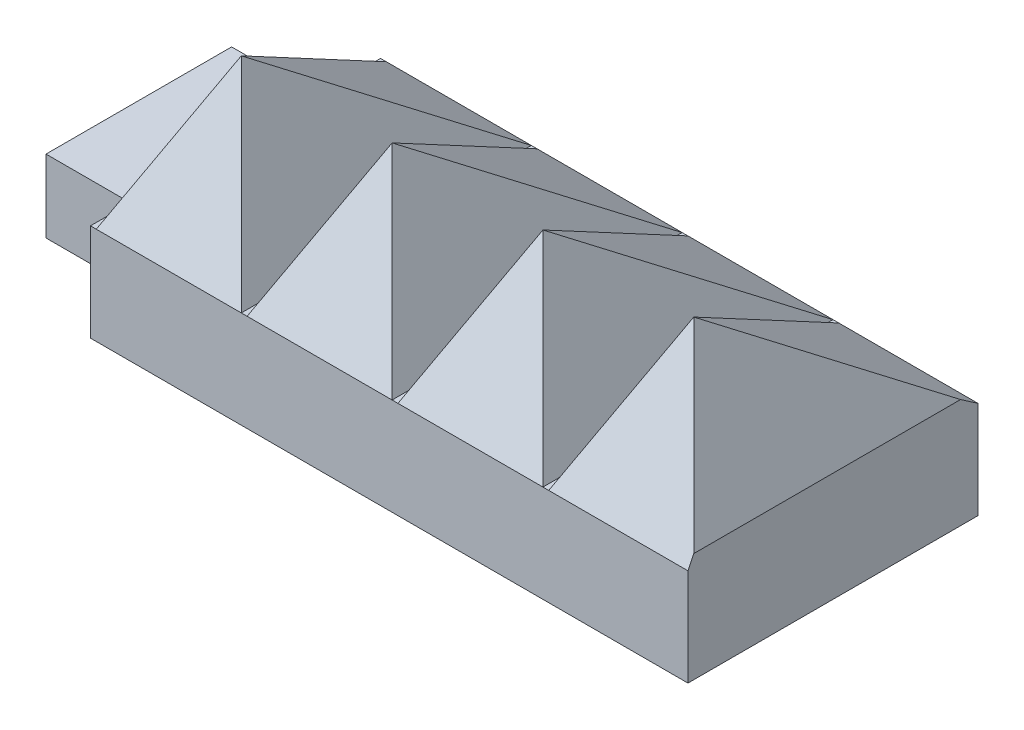
ISO-10303-21;
HEADER;
FILE_DESCRIPTION(('STEP AP214'),'2;1');
FILE_NAME('part.step','',(''),(''),'','','');
FILE_SCHEMA(('AUTOMOTIVE_DESIGN { 1 0 10303 214 1 1 1 1 }'));
ENDSEC;
DATA;
#1=APPLICATION_CONTEXT('core data for automotive mechanical design processes');
#2=APPLICATION_PROTOCOL_DEFINITION('international standard','automotive_design',2000,#1);
#3=PRODUCT_CONTEXT('',#1,'mechanical');
#4=PRODUCT('Part','Part','',(#3));
#5=PRODUCT_RELATED_PRODUCT_CATEGORY('part','',(#4));
#6=PRODUCT_DEFINITION_FORMATION('','',#4);
#7=PRODUCT_DEFINITION_CONTEXT('part definition',#1,'design');
#8=PRODUCT_DEFINITION('design','',#6,#7);
#9=PRODUCT_DEFINITION_SHAPE('','',#8);
#10=(LENGTH_UNIT() NAMED_UNIT(*) SI_UNIT(.MILLI.,.METRE.));
#11=(NAMED_UNIT(*) PLANE_ANGLE_UNIT() SI_UNIT($,.RADIAN.));
#12=(NAMED_UNIT(*) SI_UNIT($,.STERADIAN.) SOLID_ANGLE_UNIT());
#13=UNCERTAINTY_MEASURE_WITH_UNIT(LENGTH_MEASURE(1.E-05),#10,'distance_accuracy_value','');
#14=(GEOMETRIC_REPRESENTATION_CONTEXT(3) GLOBAL_UNCERTAINTY_ASSIGNED_CONTEXT((#13)) GLOBAL_UNIT_ASSIGNED_CONTEXT((#10,
#11,#12)) REPRESENTATION_CONTEXT('',''));
#15=CARTESIAN_POINT('',(0.,0.,0.));
#16=DIRECTION('',(0.,0.,1.));
#17=DIRECTION('',(1.,0.,0.));
#18=AXIS2_PLACEMENT_3D('',#15,#16,#17);
#19=CARTESIAN_POINT('',(137.922,0.,0.));
#20=DIRECTION('',(-1.,0.,0.));
#21=DIRECTION('',(0.,0.,1.));
#22=AXIS2_PLACEMENT_3D('',#19,#20,#21);
#23=PLANE('',#22);
#24=DIRECTION('',(0.,0.,1.));
#25=VECTOR('',#24,1.);
#26=CARTESIAN_POINT('',(137.922,-6.4262,0.));
#27=LINE('',#26,#25);
#28=CARTESIAN_POINT('',(137.922,-6.4262,-9.525));
#29=VERTEX_POINT('',#28);
#30=CARTESIAN_POINT('',(137.922,-6.4262,28.575));
#31=VERTEX_POINT('',#30);
#32=EDGE_CURVE('E241',#29,#31,#27,.T.);
#33=ORIENTED_EDGE('',*,*,#32,.T.);
#34=DIRECTION('',(0.,1.,0.));
#35=VECTOR('',#34,1.);
#36=CARTESIAN_POINT('',(137.922,6.35,28.575));
#37=LINE('',#36,#35);
#38=CARTESIAN_POINT('',(137.922,6.35,28.575));
#39=VERTEX_POINT('',#38);
#40=EDGE_CURVE('E233',#31,#39,#37,.T.);
#41=ORIENTED_EDGE('',*,*,#40,.T.);
#42=DIRECTION('',(0.,0.,-1.));
#43=VECTOR('',#42,1.);
#44=CARTESIAN_POINT('',(137.922,6.35,-9.525));
#45=LINE('',#44,#43);
#46=CARTESIAN_POINT('',(137.922,6.34999999999999,-9.52500000000003));
#47=VERTEX_POINT('',#46);
#48=EDGE_CURVE('E463',#39,#47,#45,.T.);
#49=ORIENTED_EDGE('',*,*,#48,.T.);
#50=DIRECTION('',(0.,1.,0.));
#51=VECTOR('',#50,1.);
#52=CARTESIAN_POINT('',(137.922,6.35,-9.525));
#53=LINE('',#52,#51);
#54=EDGE_CURVE('E230',#29,#47,#53,.T.);
#55=ORIENTED_EDGE('',*,*,#54,.F.);
#56=EDGE_LOOP('',(#33,#41,#49,#55));
#57=FACE_BOUND('',#56,.T.);
#58=DIRECTION('',(0.,0.,-1.));
#59=VECTOR('',#58,1.);
#60=CARTESIAN_POINT('',(137.922,4.7371,-2.66700000000001));
#61=LINE('',#60,#59);
#62=CARTESIAN_POINT('',(137.922,4.7371,21.717));
#63=VERTEX_POINT('',#62);
#64=CARTESIAN_POINT('',(137.922,4.7371,-2.66700000000001));
#65=VERTEX_POINT('',#64);
#66=EDGE_CURVE('E867',#63,#65,#61,.T.);
#67=ORIENTED_EDGE('',*,*,#66,.F.);
#68=DIRECTION('',(0.,1.,0.));
#69=VECTOR('',#68,1.);
#70=CARTESIAN_POINT('',(137.922,-4.8133,21.717));
#71=LINE('',#70,#69);
#72=CARTESIAN_POINT('',(137.922,-4.8133,21.717));
#73=VERTEX_POINT('',#72);
#74=EDGE_CURVE('E228',#73,#63,#71,.T.);
#75=ORIENTED_EDGE('',*,*,#74,.F.);
#76=DIRECTION('',(0.,0.,1.));
#77=VECTOR('',#76,1.);
#78=CARTESIAN_POINT('',(137.922,-4.8133,-2.66700000000001));
#79=LINE('',#78,#77);
#80=CARTESIAN_POINT('',(137.922,-4.8133,-2.66700000000001));
#81=VERTEX_POINT('',#80);
#82=EDGE_CURVE('E224',#81,#73,#79,.T.);
#83=ORIENTED_EDGE('',*,*,#82,.F.);
#84=DIRECTION('',(0.,-1.,0.));
#85=VECTOR('',#84,1.);
#86=CARTESIAN_POINT('',(137.922,-4.8133,-2.66700000000001));
#87=LINE('',#86,#85);
#88=EDGE_CURVE('E864',#65,#81,#87,.T.);
#89=ORIENTED_EDGE('',*,*,#88,.F.);
#90=EDGE_LOOP('',(#67,#75,#83,#89));
#91=FACE_BOUND('',#90,.T.);
#92=ADVANCED_FACE('F78',(#57,#91),#23,.T.);
#93=CARTESIAN_POINT('',(0.,6.35,28.575));
#94=DIRECTION('',(0.,0.,-1.));
#95=DIRECTION('',(-1.,0.,0.));
#96=AXIS2_PLACEMENT_3D('',#93,#94,#95);
#97=PLANE('',#96);
#98=ORIENTED_EDGE('',*,*,#40,.F.);
#99=DIRECTION('',(1.,0.,0.));
#100=VECTOR('',#99,1.);
#101=CARTESIAN_POINT('',(0.,-6.4262,28.575));
#102=LINE('',#101,#100);
#103=CARTESIAN_POINT('',(216.408,-6.4262,28.575));
#104=VERTEX_POINT('',#103);
#105=EDGE_CURVE('E464',#31,#104,#102,.T.);
#106=ORIENTED_EDGE('',*,*,#105,.T.);
#107=DIRECTION('',(0.,1.,0.));
#108=VECTOR('',#107,1.);
#109=CARTESIAN_POINT('',(216.408,-6.4262,28.575));
#110=LINE('',#109,#108);
#111=CARTESIAN_POINT('',(216.408,6.34999999999995,28.575));
#112=VERTEX_POINT('',#111);
#113=EDGE_CURVE('E245',#104,#112,#110,.T.);
#114=ORIENTED_EDGE('',*,*,#113,.T.);
#115=DIRECTION('',(1.,0.,0.));
#116=VECTOR('',#115,1.);
#117=CARTESIAN_POINT('',(198.12,6.35,28.575));
#118=LINE('',#117,#116);
#119=CARTESIAN_POINT('',(198.12,6.35,28.575));
#120=VERTEX_POINT('',#119);
#121=EDGE_CURVE('E327',#120,#112,#118,.T.);
#122=ORIENTED_EDGE('',*,*,#121,.F.);
#123=DIRECTION('',(1.,0.,0.));
#124=VECTOR('',#123,1.);
#125=CARTESIAN_POINT('',(0.,6.35,28.575));
#126=LINE('',#125,#124);
#127=CARTESIAN_POINT('',(197.358,6.35,28.575));
#128=VERTEX_POINT('',#127);
#129=EDGE_CURVE('E408',#128,#120,#126,.T.);
#130=ORIENTED_EDGE('',*,*,#129,.F.);
#131=DIRECTION('',(1.,0.,0.));
#132=VECTOR('',#131,1.);
#133=CARTESIAN_POINT('',(178.308,6.35,28.575));
#134=LINE('',#133,#132);
#135=CARTESIAN_POINT('',(178.308,6.35,28.575));
#136=VERTEX_POINT('',#135);
#137=EDGE_CURVE('E577',#136,#128,#134,.T.);
#138=ORIENTED_EDGE('',*,*,#137,.F.);
#139=CARTESIAN_POINT('',(177.546,6.35,28.575));
#140=VERTEX_POINT('',#139);
#141=EDGE_CURVE('E428',#140,#136,#126,.T.);
#142=ORIENTED_EDGE('',*,*,#141,.F.);
#143=DIRECTION('',(1.,0.,0.));
#144=VECTOR('',#143,1.);
#145=CARTESIAN_POINT('',(158.496,6.35,28.575));
#146=LINE('',#145,#144);
#147=CARTESIAN_POINT('',(158.496,6.35,28.575));
#148=VERTEX_POINT('',#147);
#149=EDGE_CURVE('E399',#148,#140,#146,.T.);
#150=ORIENTED_EDGE('',*,*,#149,.F.);
#151=CARTESIAN_POINT('',(157.734,6.35,28.575));
#152=VERTEX_POINT('',#151);
#153=EDGE_CURVE('E425',#152,#148,#126,.T.);
#154=ORIENTED_EDGE('',*,*,#153,.F.);
#155=DIRECTION('',(1.,0.,0.));
#156=VECTOR('',#155,1.);
#157=CARTESIAN_POINT('',(138.684,6.35,28.575));
#158=LINE('',#157,#156);
#159=CARTESIAN_POINT('',(138.684,6.35,28.575));
#160=VERTEX_POINT('',#159);
#161=EDGE_CURVE('E465',#160,#152,#158,.T.);
#162=ORIENTED_EDGE('',*,*,#161,.F.);
#163=EDGE_CURVE('E407',#39,#160,#126,.T.);
#164=ORIENTED_EDGE('',*,*,#163,.F.);
#165=EDGE_LOOP('',(#98,#106,#114,#122,#130,#138,#142,#150,#154,#162,#164));
#166=FACE_BOUND('',#165,.T.);
#167=ADVANCED_FACE('F350',(#166),#97,.F.);
#168=CARTESIAN_POINT('',(0.,6.35,-9.525));
#169=DIRECTION('',(0.,0.,-1.));
#170=DIRECTION('',(-1.,0.,0.));
#171=AXIS2_PLACEMENT_3D('',#168,#169,#170);
#172=PLANE('',#171);
#173=DIRECTION('',(1.,0.,0.));
#174=VECTOR('',#173,1.);
#175=CARTESIAN_POINT('',(0.,-6.4262,-9.525));
#176=LINE('',#175,#174);
#177=CARTESIAN_POINT('',(216.408,-6.4262,-9.525));
#178=VERTEX_POINT('',#177);
#179=EDGE_CURVE('E635',#29,#178,#176,.T.);
#180=ORIENTED_EDGE('',*,*,#179,.F.);
#181=ORIENTED_EDGE('',*,*,#54,.T.);
#182=DIRECTION('',(1.,0.,0.));
#183=VECTOR('',#182,1.);
#184=CARTESIAN_POINT('',(0.,6.35,-9.525));
#185=LINE('',#184,#183);
#186=CARTESIAN_POINT('',(138.684,6.35,-9.525));
#187=VERTEX_POINT('',#186);
#188=EDGE_CURVE('E415',#47,#187,#185,.T.);
#189=ORIENTED_EDGE('',*,*,#188,.T.);
#190=DIRECTION('',(-1.,0.,0.));
#191=VECTOR('',#190,1.);
#192=CARTESIAN_POINT('',(138.684,6.35,-9.525));
#193=LINE('',#192,#191);
#194=CARTESIAN_POINT('',(157.734,6.35,-9.525));
#195=VERTEX_POINT('',#194);
#196=EDGE_CURVE('E460',#195,#187,#193,.T.);
#197=ORIENTED_EDGE('',*,*,#196,.F.);
#198=CARTESIAN_POINT('',(158.496,6.35,-9.525));
#199=VERTEX_POINT('',#198);
#200=EDGE_CURVE('E422',#195,#199,#185,.T.);
#201=ORIENTED_EDGE('',*,*,#200,.T.);
#202=DIRECTION('',(-1.,0.,0.));
#203=VECTOR('',#202,1.);
#204=CARTESIAN_POINT('',(158.496,6.35,-9.525));
#205=LINE('',#204,#203);
#206=CARTESIAN_POINT('',(177.546,6.35,-9.525));
#207=VERTEX_POINT('',#206);
#208=EDGE_CURVE('E369',#207,#199,#205,.T.);
#209=ORIENTED_EDGE('',*,*,#208,.F.);
#210=CARTESIAN_POINT('',(178.308,6.35,-9.525));
#211=VERTEX_POINT('',#210);
#212=EDGE_CURVE('E406',#207,#211,#185,.T.);
#213=ORIENTED_EDGE('',*,*,#212,.T.);
#214=DIRECTION('',(-1.,0.,0.));
#215=VECTOR('',#214,1.);
#216=CARTESIAN_POINT('',(178.308,6.35,-9.525));
#217=LINE('',#216,#215);
#218=CARTESIAN_POINT('',(197.358,6.35,-9.525));
#219=VERTEX_POINT('',#218);
#220=EDGE_CURVE('E564',#219,#211,#217,.T.);
#221=ORIENTED_EDGE('',*,*,#220,.F.);
#222=CARTESIAN_POINT('',(198.12,6.35,-9.525));
#223=VERTEX_POINT('',#222);
#224=EDGE_CURVE('E403',#219,#223,#185,.T.);
#225=ORIENTED_EDGE('',*,*,#224,.T.);
#226=DIRECTION('',(-1.,0.,0.));
#227=VECTOR('',#226,1.);
#228=CARTESIAN_POINT('',(198.12,6.35,-9.525));
#229=LINE('',#228,#227);
#230=CARTESIAN_POINT('',(216.408,6.35,-9.525));
#231=VERTEX_POINT('',#230);
#232=EDGE_CURVE('E320',#231,#223,#229,.T.);
#233=ORIENTED_EDGE('',*,*,#232,.F.);
#234=DIRECTION('',(0.,1.,0.));
#235=VECTOR('',#234,1.);
#236=CARTESIAN_POINT('',(216.408,-6.4262,-9.525));
#237=LINE('',#236,#235);
#238=EDGE_CURVE('E253',#178,#231,#237,.T.);
#239=ORIENTED_EDGE('',*,*,#238,.F.);
#240=EDGE_LOOP('',(#180,#181,#189,#197,#201,#209,#213,#221,#225,#233,#239));
#241=FACE_BOUND('',#240,.T.);
#242=ADVANCED_FACE('F340',(#241),#172,.T.);
#243=CARTESIAN_POINT('',(0.,-6.4262,0.));
#244=DIRECTION('',(0.,1.,0.));
#245=DIRECTION('',(0.,0.,1.));
#246=AXIS2_PLACEMENT_3D('',#243,#244,#245);
#247=PLANE('',#246);
#248=CARTESIAN_POINT('',(179.07,-6.4262,9.525));
#249=DIRECTION('',(0.,1.,0.));
#250=DIRECTION('',(0.,0.,1.));
#251=AXIS2_PLACEMENT_3D('',#248,#249,#250);
#252=CIRCLE('',#251,12.192);
#253=CARTESIAN_POINT('',(179.07,-6.4262,21.717));
#254=VERTEX_POINT('',#253);
#255=EDGE_CURVE('E88',#254,#254,#252,.F.);
#256=ORIENTED_EDGE('',*,*,#255,.F.);
#257=EDGE_LOOP('',(#256));
#258=FACE_BOUND('',#257,.T.);
#259=ORIENTED_EDGE('',*,*,#32,.F.);
#260=ORIENTED_EDGE('',*,*,#179,.T.);
#261=DIRECTION('',(0.,0.,-1.));
#262=VECTOR('',#261,1.);
#263=CARTESIAN_POINT('',(216.408,-6.4262,28.575));
#264=LINE('',#263,#262);
#265=EDGE_CURVE('E254',#104,#178,#264,.T.);
#266=ORIENTED_EDGE('',*,*,#265,.F.);
#267=ORIENTED_EDGE('',*,*,#105,.F.);
#268=EDGE_LOOP('',(#259,#260,#266,#267));
#269=FACE_BOUND('',#268,.T.);
#270=ADVANCED_FACE('F349',(#258,#269),#247,.F.);
#271=CARTESIAN_POINT('',(0.,6.35,0.));
#272=DIRECTION('',(0.,1.,0.));
#273=DIRECTION('',(0.,0.,1.));
#274=AXIS2_PLACEMENT_3D('',#271,#272,#273);
#275=PLANE('',#274);
#276=ORIENTED_EDGE('',*,*,#129,.T.);
#277=DIRECTION('',(0.,0.,1.));
#278=VECTOR('',#277,1.);
#279=CARTESIAN_POINT('',(198.12,6.35,-9.525));
#280=LINE('',#279,#278);
#281=EDGE_CURVE('E338',#223,#120,#280,.T.);
#282=ORIENTED_EDGE('',*,*,#281,.F.);
#283=ORIENTED_EDGE('',*,*,#224,.F.);
#284=DIRECTION('',(0.,0.,-1.));
#285=VECTOR('',#284,1.);
#286=CARTESIAN_POINT('',(197.358,6.35,-9.525));
#287=LINE('',#286,#285);
#288=EDGE_CURVE('E570',#128,#219,#287,.T.);
#289=ORIENTED_EDGE('',*,*,#288,.F.);
#290=EDGE_LOOP('',(#276,#282,#283,#289));
#291=FACE_BOUND('',#290,.T.);
#292=ADVANCED_FACE('F80',(#291),#275,.T.);
#293=ORIENTED_EDGE('',*,*,#141,.T.);
#294=DIRECTION('',(0.,0.,1.));
#295=VECTOR('',#294,1.);
#296=CARTESIAN_POINT('',(178.308,6.35,-9.525));
#297=LINE('',#296,#295);
#298=EDGE_CURVE('E584',#211,#136,#297,.T.);
#299=ORIENTED_EDGE('',*,*,#298,.F.);
#300=ORIENTED_EDGE('',*,*,#212,.F.);
#301=DIRECTION('',(0.,0.,-1.));
#302=VECTOR('',#301,1.);
#303=CARTESIAN_POINT('',(177.546,6.35,-9.525));
#304=LINE('',#303,#302);
#305=EDGE_CURVE('E379',#140,#207,#304,.T.);
#306=ORIENTED_EDGE('',*,*,#305,.F.);
#307=EDGE_LOOP('',(#293,#299,#300,#306));
#308=FACE_BOUND('',#307,.T.);
#309=ADVANCED_FACE('F649',(#308),#275,.T.);
#310=ORIENTED_EDGE('',*,*,#153,.T.);
#311=DIRECTION('',(0.,0.,1.));
#312=VECTOR('',#311,1.);
#313=CARTESIAN_POINT('',(158.496,6.35,-9.525));
#314=LINE('',#313,#312);
#315=EDGE_CURVE('E380',#199,#148,#314,.T.);
#316=ORIENTED_EDGE('',*,*,#315,.F.);
#317=ORIENTED_EDGE('',*,*,#200,.F.);
#318=DIRECTION('',(0.,0.,-1.));
#319=VECTOR('',#318,1.);
#320=CARTESIAN_POINT('',(157.734,6.35,-9.525));
#321=LINE('',#320,#319);
#322=EDGE_CURVE('E434',#152,#195,#321,.T.);
#323=ORIENTED_EDGE('',*,*,#322,.F.);
#324=EDGE_LOOP('',(#310,#316,#317,#323));
#325=FACE_BOUND('',#324,.T.);
#326=ADVANCED_FACE('F511',(#325),#275,.T.);
#327=ORIENTED_EDGE('',*,*,#163,.T.);
#328=DIRECTION('',(0.,0.,1.));
#329=VECTOR('',#328,1.);
#330=CARTESIAN_POINT('',(138.684,6.35,-9.525));
#331=LINE('',#330,#329);
#332=EDGE_CURVE('E449',#187,#160,#331,.T.);
#333=ORIENTED_EDGE('',*,*,#332,.F.);
#334=ORIENTED_EDGE('',*,*,#188,.F.);
#335=ORIENTED_EDGE('',*,*,#48,.F.);
#336=EDGE_LOOP('',(#327,#333,#334,#335));
#337=FACE_BOUND('',#336,.T.);
#338=ADVANCED_FACE('F650',(#337),#275,.T.);
#339=CARTESIAN_POINT('',(136.197317378927,1.20090918596555,0.));
#340=DIRECTION('',(0.900489002239912,-0.434878784082378,0.));
#341=DIRECTION('',(0.434878784082378,0.900489002239912,0.));
#342=AXIS2_PLACEMENT_3D('',#339,#340,#341);
#343=PLANE('',#342);
#344=DIRECTION('',(0.398800284879998,0.825782456558182,-0.398800284879998));
#345=VECTOR('',#344,1.);
#346=CARTESIAN_POINT('',(138.684,6.35,28.575));
#347=LINE('',#346,#345);
#348=CARTESIAN_POINT('',(148.209,26.0731,19.05));
#349=VERTEX_POINT('',#348);
#350=EDGE_CURVE('E1010',#160,#349,#347,.T.);
#351=ORIENTED_EDGE('',*,*,#350,.T.);
#352=DIRECTION('',(0.264557111265544,0.547809591727186,0.793671333796632));
#353=VECTOR('',#352,1.);
#354=CARTESIAN_POINT('',(138.684,6.35,-9.525));
#355=LINE('',#354,#353);
#356=EDGE_CURVE('E1014',#187,#349,#355,.T.);
#357=ORIENTED_EDGE('',*,*,#356,.F.);
#358=ORIENTED_EDGE('',*,*,#332,.T.);
#359=EDGE_LOOP('',(#351,#357,#358));
#360=FACE_BOUND('',#359,.T.);
#361=ADVANCED_FACE('F810',(#360),#343,.F.);
#362=CARTESIAN_POINT('',(138.684,8.7539338084631,-6.04215964646364));
#363=DIRECTION('',(0.,-0.82299461575022,0.568049172560041));
#364=DIRECTION('',(0.,-0.568049172560041,-0.82299461575022));
#365=AXIS2_PLACEMENT_3D('',#362,#363,#364);
#366=PLANE('',#365);
#367=ORIENTED_EDGE('',*,*,#356,.T.);
#368=DIRECTION('',(-0.264557111265544,0.547809591727186,0.793671333796632));
#369=VECTOR('',#368,1.);
#370=CARTESIAN_POINT('',(157.734,6.35,-9.525));
#371=LINE('',#370,#369);
#372=EDGE_CURVE('E378',#195,#349,#371,.T.);
#373=ORIENTED_EDGE('',*,*,#372,.F.);
#374=ORIENTED_EDGE('',*,*,#196,.T.);
#375=EDGE_LOOP('',(#367,#373,#374));
#376=FACE_BOUND('',#375,.T.);
#377=ADVANCED_FACE('F879',(#376),#366,.F.);
#378=CARTESIAN_POINT('',(138.684,12.3909809807925,25.6575912842277));
#379=DIRECTION('',(0.,-0.434878784082379,-0.900489002239912));
#380=DIRECTION('',(0.,0.900489002239912,-0.434878784082379));
#381=AXIS2_PLACEMENT_3D('',#378,#379,#380);
#382=PLANE('',#381);
#383=DIRECTION('',(-0.398800284879998,0.825782456558182,-0.398800284879998));
#384=VECTOR('',#383,1.);
#385=CARTESIAN_POINT('',(157.734,6.35,28.575));
#386=LINE('',#385,#384);
#387=EDGE_CURVE('E1007',#152,#349,#386,.T.);
#388=ORIENTED_EDGE('',*,*,#387,.T.);
#389=ORIENTED_EDGE('',*,*,#350,.F.);
#390=ORIENTED_EDGE('',*,*,#161,.T.);
#391=EDGE_LOOP('',(#388,#389,#390));
#392=FACE_BOUND('',#391,.T.);
#393=ADVANCED_FACE('F887',(#392),#382,.F.);
#394=CARTESIAN_POINT('',(156.617955063176,8.66095704918353,0.));
#395=DIRECTION('',(-0.900489002239912,-0.434878784082379,0.));
#396=DIRECTION('',(0.434878784082379,-0.900489002239912,0.));
#397=AXIS2_PLACEMENT_3D('',#394,#395,#396);
#398=PLANE('',#397);
#399=ORIENTED_EDGE('',*,*,#372,.T.);
#400=ORIENTED_EDGE('',*,*,#387,.F.);
#401=ORIENTED_EDGE('',*,*,#322,.T.);
#402=EDGE_LOOP('',(#399,#400,#401));
#403=FACE_BOUND('',#402,.T.);
#404=ADVANCED_FACE('F543',(#403),#398,.F.);
#405=CARTESIAN_POINT('',(156.009317378927,1.20090918596555,0.));
#406=DIRECTION('',(0.900489002239912,-0.434878784082378,0.));
#407=DIRECTION('',(0.434878784082378,0.900489002239912,0.));
#408=AXIS2_PLACEMENT_3D('',#405,#406,#407);
#409=PLANE('',#408);
#410=DIRECTION('',(0.398800284879998,0.825782456558182,-0.398800284879998));
#411=VECTOR('',#410,1.);
#412=CARTESIAN_POINT('',(158.496,6.35,28.575));
#413=LINE('',#412,#411);
#414=CARTESIAN_POINT('',(168.021,26.0731,19.05));
#415=VERTEX_POINT('',#414);
#416=EDGE_CURVE('E517',#148,#415,#413,.T.);
#417=ORIENTED_EDGE('',*,*,#416,.T.);
#418=DIRECTION('',(0.264557111265544,0.547809591727186,0.793671333796632));
#419=VECTOR('',#418,1.);
#420=CARTESIAN_POINT('',(158.496,6.35,-9.525));
#421=LINE('',#420,#419);
#422=EDGE_CURVE('E516',#199,#415,#421,.T.);
#423=ORIENTED_EDGE('',*,*,#422,.F.);
#424=ORIENTED_EDGE('',*,*,#315,.T.);
#425=EDGE_LOOP('',(#417,#423,#424));
#426=FACE_BOUND('',#425,.T.);
#427=ADVANCED_FACE('F532',(#426),#409,.F.);
#428=CARTESIAN_POINT('',(158.496,8.7539338084631,-6.04215964646364));
#429=DIRECTION('',(0.,-0.82299461575022,0.568049172560041));
#430=DIRECTION('',(0.,-0.568049172560041,-0.82299461575022));
#431=AXIS2_PLACEMENT_3D('',#428,#429,#430);
#432=PLANE('',#431);
#433=ORIENTED_EDGE('',*,*,#422,.T.);
#434=DIRECTION('',(-0.264557111265544,0.547809591727186,0.793671333796632));
#435=VECTOR('',#434,1.);
#436=CARTESIAN_POINT('',(177.546,6.35,-9.525));
#437=LINE('',#436,#435);
#438=EDGE_CURVE('E557',#207,#415,#437,.T.);
#439=ORIENTED_EDGE('',*,*,#438,.F.);
#440=ORIENTED_EDGE('',*,*,#208,.T.);
#441=EDGE_LOOP('',(#433,#439,#440));
#442=FACE_BOUND('',#441,.T.);
#443=ADVANCED_FACE('F542',(#442),#432,.F.);
#444=CARTESIAN_POINT('',(158.496,12.3909809807925,25.6575912842277));
#445=DIRECTION('',(0.,-0.434878784082379,-0.900489002239912));
#446=DIRECTION('',(0.,0.900489002239912,-0.434878784082379));
#447=AXIS2_PLACEMENT_3D('',#444,#445,#446);
#448=PLANE('',#447);
#449=DIRECTION('',(-0.398800284879998,0.825782456558182,-0.398800284879998));
#450=VECTOR('',#449,1.);
#451=CARTESIAN_POINT('',(177.546,6.35,28.575));
#452=LINE('',#451,#450);
#453=EDGE_CURVE('E520',#140,#415,#452,.T.);
#454=ORIENTED_EDGE('',*,*,#453,.T.);
#455=ORIENTED_EDGE('',*,*,#416,.F.);
#456=ORIENTED_EDGE('',*,*,#149,.T.);
#457=EDGE_LOOP('',(#454,#455,#456));
#458=FACE_BOUND('',#457,.T.);
#459=ADVANCED_FACE('F550',(#458),#448,.F.);
#460=CARTESIAN_POINT('',(176.429955063176,8.66095704918353,0.));
#461=DIRECTION('',(-0.900489002239912,-0.434878784082379,0.));
#462=DIRECTION('',(0.434878784082379,-0.900489002239912,0.));
#463=AXIS2_PLACEMENT_3D('',#460,#461,#462);
#464=PLANE('',#463);
#465=ORIENTED_EDGE('',*,*,#438,.T.);
#466=ORIENTED_EDGE('',*,*,#453,.F.);
#467=ORIENTED_EDGE('',*,*,#305,.T.);
#468=EDGE_LOOP('',(#465,#466,#467));
#469=FACE_BOUND('',#468,.T.);
#470=ADVANCED_FACE('F724',(#469),#464,.F.);
#471=CARTESIAN_POINT('',(175.821317378927,1.20090918596555,0.));
#472=DIRECTION('',(0.900489002239912,-0.434878784082378,0.));
#473=DIRECTION('',(0.434878784082378,0.900489002239912,0.));
#474=AXIS2_PLACEMENT_3D('',#471,#472,#473);
#475=PLANE('',#474);
#476=DIRECTION('',(0.398800284879998,0.825782456558182,-0.398800284879998));
#477=VECTOR('',#476,1.);
#478=CARTESIAN_POINT('',(178.308,6.35,28.575));
#479=LINE('',#478,#477);
#480=CARTESIAN_POINT('',(187.833,26.0731,19.05));
#481=VERTEX_POINT('',#480);
#482=EDGE_CURVE('E694',#136,#481,#479,.T.);
#483=ORIENTED_EDGE('',*,*,#482,.T.);
#484=DIRECTION('',(0.264557111265544,0.547809591727186,0.793671333796632));
#485=VECTOR('',#484,1.);
#486=CARTESIAN_POINT('',(178.308,6.35,-9.525));
#487=LINE('',#486,#485);
#488=EDGE_CURVE('E703',#211,#481,#487,.T.);
#489=ORIENTED_EDGE('',*,*,#488,.F.);
#490=ORIENTED_EDGE('',*,*,#298,.T.);
#491=EDGE_LOOP('',(#483,#489,#490));
#492=FACE_BOUND('',#491,.T.);
#493=ADVANCED_FACE('F715',(#492),#475,.F.);
#494=CARTESIAN_POINT('',(178.308,8.7539338084631,-6.04215964646364));
#495=DIRECTION('',(0.,-0.82299461575022,0.568049172560041));
#496=DIRECTION('',(0.,-0.568049172560041,-0.82299461575022));
#497=AXIS2_PLACEMENT_3D('',#494,#495,#496);
#498=PLANE('',#497);
#499=ORIENTED_EDGE('',*,*,#488,.T.);
#500=DIRECTION('',(-0.264557111265544,0.547809591727186,0.793671333796632));
#501=VECTOR('',#500,1.);
#502=CARTESIAN_POINT('',(197.358,6.35,-9.525));
#503=LINE('',#502,#501);
#504=EDGE_CURVE('E690',#219,#481,#503,.T.);
#505=ORIENTED_EDGE('',*,*,#504,.F.);
#506=ORIENTED_EDGE('',*,*,#220,.T.);
#507=EDGE_LOOP('',(#499,#505,#506));
#508=FACE_BOUND('',#507,.T.);
#509=ADVANCED_FACE('F723',(#508),#498,.F.);
#510=CARTESIAN_POINT('',(178.308,12.3909809807925,25.6575912842277));
#511=DIRECTION('',(0.,-0.434878784082379,-0.900489002239912));
#512=DIRECTION('',(0.,0.900489002239912,-0.434878784082379));
#513=AXIS2_PLACEMENT_3D('',#510,#511,#512);
#514=PLANE('',#513);
#515=DIRECTION('',(-0.398800284879998,0.825782456558182,-0.398800284879998));
#516=VECTOR('',#515,1.);
#517=CARTESIAN_POINT('',(197.358,6.35,28.575));
#518=LINE('',#517,#516);
#519=EDGE_CURVE('E691',#128,#481,#518,.T.);
#520=ORIENTED_EDGE('',*,*,#519,.T.);
#521=ORIENTED_EDGE('',*,*,#482,.F.);
#522=ORIENTED_EDGE('',*,*,#137,.T.);
#523=EDGE_LOOP('',(#520,#521,#522));
#524=FACE_BOUND('',#523,.T.);
#525=ADVANCED_FACE('F727',(#524),#514,.F.);
#526=CARTESIAN_POINT('',(196.241955063176,8.66095704918353,0.));
#527=DIRECTION('',(-0.900489002239912,-0.434878784082379,0.));
#528=DIRECTION('',(0.434878784082379,-0.900489002239912,0.));
#529=AXIS2_PLACEMENT_3D('',#526,#527,#528);
#530=PLANE('',#529);
#531=ORIENTED_EDGE('',*,*,#504,.T.);
#532=ORIENTED_EDGE('',*,*,#519,.F.);
#533=ORIENTED_EDGE('',*,*,#288,.T.);
#534=EDGE_LOOP('',(#531,#532,#533));
#535=FACE_BOUND('',#534,.T.);
#536=ADVANCED_FACE('F544',(#535),#530,.F.);
#537=CARTESIAN_POINT('',(195.633317378927,1.20090918596555,0.));
#538=DIRECTION('',(0.900489002239912,-0.434878784082378,0.));
#539=DIRECTION('',(0.434878784082378,0.900489002239912,0.));
#540=AXIS2_PLACEMENT_3D('',#537,#538,#539);
#541=PLANE('',#540);
#542=DIRECTION('',(0.398800284879998,0.825782456558182,-0.398800284879998));
#543=VECTOR('',#542,1.);
#544=CARTESIAN_POINT('',(198.12,6.35,28.575));
#545=LINE('',#544,#543);
#546=CARTESIAN_POINT('',(207.645,26.0731,19.05));
#547=VERTEX_POINT('',#546);
#548=EDGE_CURVE('E315',#120,#547,#545,.T.);
#549=ORIENTED_EDGE('',*,*,#548,.T.);
#550=DIRECTION('',(0.264557111265544,0.547809591727186,0.793671333796632));
#551=VECTOR('',#550,1.);
#552=CARTESIAN_POINT('',(198.12,6.35,-9.525));
#553=LINE('',#552,#551);
#554=EDGE_CURVE('E610',#223,#547,#553,.T.);
#555=ORIENTED_EDGE('',*,*,#554,.F.);
#556=ORIENTED_EDGE('',*,*,#281,.T.);
#557=EDGE_LOOP('',(#549,#555,#556));
#558=FACE_BOUND('',#557,.T.);
#559=ADVANCED_FACE('F286',(#558),#541,.F.);
#560=CARTESIAN_POINT('',(198.12,8.7539338084631,-6.04215964646364));
#561=DIRECTION('',(0.,-0.82299461575022,0.568049172560041));
#562=DIRECTION('',(0.,-0.568049172560041,-0.82299461575022));
#563=AXIS2_PLACEMENT_3D('',#560,#561,#562);
#564=PLANE('',#563);
#565=DIRECTION('',(-0.264557111265544,0.547809591727186,0.793671333796632));
#566=VECTOR('',#565,1.);
#567=CARTESIAN_POINT('',(217.17,6.35,-9.525));
#568=LINE('',#567,#566);
#569=CARTESIAN_POINT('',(216.408,7.92784800000001,-7.23899999999999));
#570=VERTEX_POINT('',#569);
#571=EDGE_CURVE('E267',#570,#547,#568,.T.);
#572=ORIENTED_EDGE('',*,*,#571,.F.);
#573=DIRECTION('',(0.,-0.568049172560041,-0.82299461575022));
#574=VECTOR('',#573,1.);
#575=CARTESIAN_POINT('',(216.408,8.7539338084631,-6.04215964646364));
#576=LINE('',#575,#574);
#577=EDGE_CURVE('E104',#570,#231,#576,.T.);
#578=ORIENTED_EDGE('',*,*,#577,.T.);
#579=ORIENTED_EDGE('',*,*,#232,.T.);
#580=ORIENTED_EDGE('',*,*,#554,.T.);
#581=EDGE_LOOP('',(#572,#578,#579,#580));
#582=FACE_BOUND('',#581,.T.);
#583=ADVANCED_FACE('F275',(#582),#564,.F.);
#584=CARTESIAN_POINT('',(198.12,12.3909809807925,25.6575912842277));
#585=DIRECTION('',(0.,-0.434878784082379,-0.900489002239912));
#586=DIRECTION('',(0.,0.900489002239912,-0.434878784082379));
#587=AXIS2_PLACEMENT_3D('',#584,#585,#586);
#588=PLANE('',#587);
#589=ORIENTED_EDGE('',*,*,#121,.T.);
#590=DIRECTION('',(0.,0.900489002239912,-0.434878784082379));
#591=VECTOR('',#590,1.);
#592=CARTESIAN_POINT('',(216.408,12.3909809807925,25.6575912842277));
#593=LINE('',#592,#591);
#594=CARTESIAN_POINT('',(216.408,7.92784800000002,27.813));
#595=VERTEX_POINT('',#594);
#596=EDGE_CURVE('E256',#112,#595,#593,.T.);
#597=ORIENTED_EDGE('',*,*,#596,.T.);
#598=DIRECTION('',(-0.398800284879998,0.825782456558182,-0.398800284879998));
#599=VECTOR('',#598,1.);
#600=CARTESIAN_POINT('',(217.17,6.35,28.575));
#601=LINE('',#600,#599);
#602=EDGE_CURVE('E313',#595,#547,#601,.T.);
#603=ORIENTED_EDGE('',*,*,#602,.T.);
#604=ORIENTED_EDGE('',*,*,#548,.F.);
#605=EDGE_LOOP('',(#589,#597,#603,#604));
#606=FACE_BOUND('',#605,.T.);
#607=ADVANCED_FACE('F285',(#606),#588,.F.);
#608=CARTESIAN_POINT('',(216.053955063176,8.66095704918353,0.));
#609=DIRECTION('',(-0.900489002239912,-0.434878784082379,0.));
#610=DIRECTION('',(0.434878784082379,-0.900489002239912,0.));
#611=AXIS2_PLACEMENT_3D('',#608,#609,#610);
#612=PLANE('',#611);
#613=ORIENTED_EDGE('',*,*,#602,.F.);
#614=DIRECTION('',(0.,0.,-1.));
#615=VECTOR('',#614,1.);
#616=CARTESIAN_POINT('',(216.408,7.92784800000001,0.));
#617=LINE('',#616,#615);
#618=EDGE_CURVE('E12',#595,#570,#617,.T.);
#619=ORIENTED_EDGE('',*,*,#618,.T.);
#620=ORIENTED_EDGE('',*,*,#571,.T.);
#621=EDGE_LOOP('',(#613,#619,#620));
#622=FACE_BOUND('',#621,.T.);
#623=ADVANCED_FACE('F293',(#622),#612,.F.);
#624=CARTESIAN_POINT('',(179.07,-12.7762,9.525));
#625=DIRECTION('',(0.,1.,0.));
#626=DIRECTION('',(0.,0.,1.));
#627=AXIS2_PLACEMENT_3D('',#624,#625,#626);
#628=CYLINDRICAL_SURFACE('',#627,12.192);
#629=CARTESIAN_POINT('',(179.07,-12.7762,9.525));
#630=DIRECTION('',(0.,-1.,0.));
#631=DIRECTION('',(0.,0.,-1.));
#632=AXIS2_PLACEMENT_3D('',#629,#630,#631);
#633=CIRCLE('',#632,12.192);
#634=CARTESIAN_POINT('',(179.07,-12.7762,-2.66700000000002));
#635=VERTEX_POINT('',#634);
#636=EDGE_CURVE('E262',#635,#635,#633,.T.);
#637=ORIENTED_EDGE('',*,*,#636,.F.);
#638=EDGE_LOOP('',(#637));
#639=FACE_BOUND('',#638,.T.);
#640=ORIENTED_EDGE('',*,*,#255,.T.);
#641=EDGE_LOOP('',(#640));
#642=FACE_BOUND('',#641,.T.);
#643=ADVANCED_FACE('F666',(#639,#642),#628,.T.);
#644=CARTESIAN_POINT('',(179.07,-12.7762,9.525));
#645=DIRECTION('',(0.,-1.,0.));
#646=DIRECTION('',(0.,0.,-1.));
#647=AXIS2_PLACEMENT_3D('',#644,#645,#646);
#648=PLANE('',#647);
#649=ORIENTED_EDGE('',*,*,#636,.T.);
#650=EDGE_LOOP('',(#649));
#651=FACE_BOUND('',#650,.T.);
#652=ADVANCED_FACE('F664',(#651),#648,.T.);
#653=CARTESIAN_POINT('',(216.408,0.,0.));
#654=DIRECTION('',(-1.,0.,0.));
#655=DIRECTION('',(0.,0.,1.));
#656=AXIS2_PLACEMENT_3D('',#653,#654,#655);
#657=PLANE('',#656);
#658=ORIENTED_EDGE('',*,*,#618,.F.);
#659=ORIENTED_EDGE('',*,*,#596,.F.);
#660=ORIENTED_EDGE('',*,*,#113,.F.);
#661=ORIENTED_EDGE('',*,*,#265,.T.);
#662=ORIENTED_EDGE('',*,*,#238,.T.);
#663=ORIENTED_EDGE('',*,*,#577,.F.);
#664=EDGE_LOOP('',(#658,#659,#660,#661,#662,#663));
#665=FACE_BOUND('',#664,.T.);
#666=ADVANCED_FACE('F643',(#665),#657,.F.);
#667=CARTESIAN_POINT('',(125.222,-4.8133,21.717));
#668=DIRECTION('',(0.,0.,-1.));
#669=DIRECTION('',(-1.,0.,0.));
#670=AXIS2_PLACEMENT_3D('',#667,#668,#669);
#671=PLANE('',#670);
#672=ORIENTED_EDGE('',*,*,#74,.T.);
#673=DIRECTION('',(1.,0.,0.));
#674=VECTOR('',#673,1.);
#675=CARTESIAN_POINT('',(125.222,4.7371,21.717));
#676=LINE('',#675,#674);
#677=CARTESIAN_POINT('',(125.222,4.7371,21.717));
#678=VERTEX_POINT('',#677);
#679=EDGE_CURVE('E209',#678,#63,#676,.T.);
#680=ORIENTED_EDGE('',*,*,#679,.F.);
#681=DIRECTION('',(0.,1.,0.));
#682=VECTOR('',#681,1.);
#683=CARTESIAN_POINT('',(125.222,-4.8133,21.717));
#684=LINE('',#683,#682);
#685=CARTESIAN_POINT('',(125.222,-4.8133,21.717));
#686=VERTEX_POINT('',#685);
#687=EDGE_CURVE('E216',#686,#678,#684,.T.);
#688=ORIENTED_EDGE('',*,*,#687,.F.);
#689=DIRECTION('',(1.,0.,0.));
#690=VECTOR('',#689,1.);
#691=CARTESIAN_POINT('',(125.222,-4.8133,21.717));
#692=LINE('',#691,#690);
#693=EDGE_CURVE('E862',#686,#73,#692,.T.);
#694=ORIENTED_EDGE('',*,*,#693,.T.);
#695=EDGE_LOOP('',(#672,#680,#688,#694));
#696=FACE_BOUND('',#695,.T.);
#697=ADVANCED_FACE('F226',(#696),#671,.F.);
#698=CARTESIAN_POINT('',(125.222,4.7371,-2.667));
#699=DIRECTION('',(0.,-1.,0.));
#700=DIRECTION('',(0.,0.,-1.));
#701=AXIS2_PLACEMENT_3D('',#698,#699,#700);
#702=PLANE('',#701);
#703=ORIENTED_EDGE('',*,*,#66,.T.);
#704=DIRECTION('',(1.,0.,0.));
#705=VECTOR('',#704,1.);
#706=CARTESIAN_POINT('',(125.222,4.7371,-2.667));
#707=LINE('',#706,#705);
#708=CARTESIAN_POINT('',(125.222,4.7371,-2.667));
#709=VERTEX_POINT('',#708);
#710=EDGE_CURVE('E212',#709,#65,#707,.T.);
#711=ORIENTED_EDGE('',*,*,#710,.F.);
#712=DIRECTION('',(0.,0.,-1.));
#713=VECTOR('',#712,1.);
#714=CARTESIAN_POINT('',(125.222,4.7371,-2.667));
#715=LINE('',#714,#713);
#716=EDGE_CURVE('E205',#678,#709,#715,.T.);
#717=ORIENTED_EDGE('',*,*,#716,.F.);
#718=ORIENTED_EDGE('',*,*,#679,.T.);
#719=EDGE_LOOP('',(#703,#711,#717,#718));
#720=FACE_BOUND('',#719,.T.);
#721=ADVANCED_FACE('F207',(#720),#702,.F.);
#722=CARTESIAN_POINT('',(125.222,-4.8133,-2.667));
#723=DIRECTION('',(0.,0.,1.));
#724=DIRECTION('',(1.,0.,0.));
#725=AXIS2_PLACEMENT_3D('',#722,#723,#724);
#726=PLANE('',#725);
#727=ORIENTED_EDGE('',*,*,#88,.T.);
#728=DIRECTION('',(1.,0.,0.));
#729=VECTOR('',#728,1.);
#730=CARTESIAN_POINT('',(125.222,-4.8133,-2.667));
#731=LINE('',#730,#729);
#732=CARTESIAN_POINT('',(125.222,-4.8133,-2.667));
#733=VERTEX_POINT('',#732);
#734=EDGE_CURVE('E96',#733,#81,#731,.T.);
#735=ORIENTED_EDGE('',*,*,#734,.F.);
#736=DIRECTION('',(0.,-1.,0.));
#737=VECTOR('',#736,1.);
#738=CARTESIAN_POINT('',(125.222,-4.8133,-2.667));
#739=LINE('',#738,#737);
#740=EDGE_CURVE('E215',#709,#733,#739,.T.);
#741=ORIENTED_EDGE('',*,*,#740,.F.);
#742=ORIENTED_EDGE('',*,*,#710,.T.);
#743=EDGE_LOOP('',(#727,#735,#741,#742));
#744=FACE_BOUND('',#743,.T.);
#745=ADVANCED_FACE('F832',(#744),#726,.F.);
#746=CARTESIAN_POINT('',(125.222,-4.8133,-2.667));
#747=DIRECTION('',(0.,1.,0.));
#748=DIRECTION('',(0.,0.,1.));
#749=AXIS2_PLACEMENT_3D('',#746,#747,#748);
#750=PLANE('',#749);
#751=ORIENTED_EDGE('',*,*,#82,.T.);
#752=ORIENTED_EDGE('',*,*,#693,.F.);
#753=DIRECTION('',(0.,0.,1.));
#754=VECTOR('',#753,1.);
#755=CARTESIAN_POINT('',(125.222,-4.8133,-2.667));
#756=LINE('',#755,#754);
#757=EDGE_CURVE('E220',#733,#686,#756,.T.);
#758=ORIENTED_EDGE('',*,*,#757,.F.);
#759=ORIENTED_EDGE('',*,*,#734,.T.);
#760=EDGE_LOOP('',(#751,#752,#758,#759));
#761=FACE_BOUND('',#760,.T.);
#762=ADVANCED_FACE('F840',(#761),#750,.F.);
#763=CARTESIAN_POINT('',(125.222,0.,0.));
#764=DIRECTION('',(1.,0.,0.));
#765=DIRECTION('',(0.,0.,-1.));
#766=AXIS2_PLACEMENT_3D('',#763,#764,#765);
#767=PLANE('',#766);
#768=ORIENTED_EDGE('',*,*,#687,.T.);
#769=ORIENTED_EDGE('',*,*,#716,.T.);
#770=ORIENTED_EDGE('',*,*,#740,.T.);
#771=ORIENTED_EDGE('',*,*,#757,.T.);
#772=EDGE_LOOP('',(#768,#769,#770,#771));
#773=FACE_BOUND('',#772,.T.);
#774=ADVANCED_FACE('F219',(#773),#767,.F.);
#775=CLOSED_SHELL('',(#92,#167,#242,#270,#292,#309,#326,#338,#361,#377,#393,#404,#427,#443,#459,
#470,#493,#509,#525,#536,#559,#583,#607,#623,#643,#652,#666,#697,#721,#745,#762,#774));
#776=MANIFOLD_SOLID_BREP('B2',#775);
#777=ADVANCED_BREP_SHAPE_REPRESENTATION('',(#18,#776),#14);
#778=SHAPE_DEFINITION_REPRESENTATION(#9,#777);
ENDSEC;
END-ISO-10303-21;
